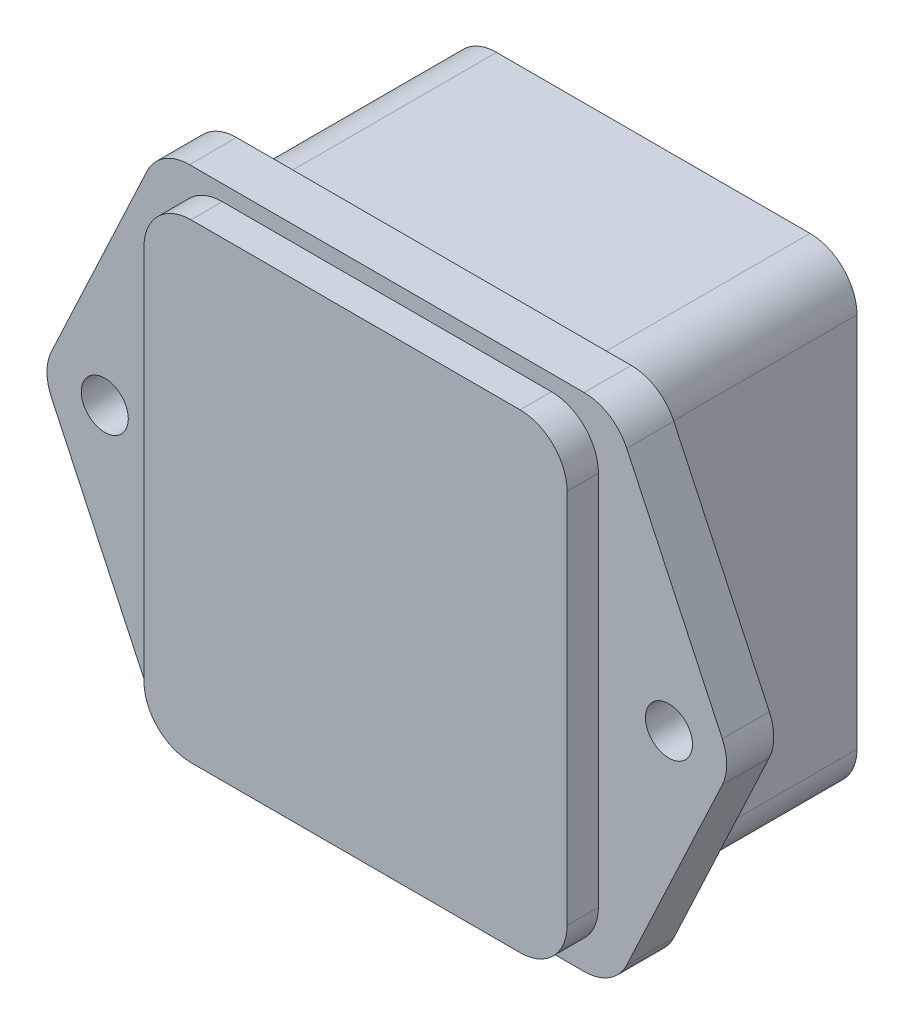
ISO-10303-21;
HEADER;
FILE_DESCRIPTION(('STEP AP214'),'2;1');
FILE_NAME('part.step','',(''),(''),'','','');
FILE_SCHEMA(('AUTOMOTIVE_DESIGN { 1 0 10303 214 1 1 1 1 }'));
ENDSEC;
DATA;
#1=APPLICATION_CONTEXT('core data for automotive mechanical design processes');
#2=APPLICATION_PROTOCOL_DEFINITION('international standard','automotive_design',2000,#1);
#3=PRODUCT_CONTEXT('',#1,'mechanical');
#4=PRODUCT('Part','Part','',(#3));
#5=PRODUCT_RELATED_PRODUCT_CATEGORY('part','',(#4));
#6=PRODUCT_DEFINITION_FORMATION('','',#4);
#7=PRODUCT_DEFINITION_CONTEXT('part definition',#1,'design');
#8=PRODUCT_DEFINITION('design','',#6,#7);
#9=PRODUCT_DEFINITION_SHAPE('','',#8);
#10=(LENGTH_UNIT() NAMED_UNIT(*) SI_UNIT(.MILLI.,.METRE.));
#11=(NAMED_UNIT(*) PLANE_ANGLE_UNIT() SI_UNIT($,.RADIAN.));
#12=(NAMED_UNIT(*) SI_UNIT($,.STERADIAN.) SOLID_ANGLE_UNIT());
#13=UNCERTAINTY_MEASURE_WITH_UNIT(LENGTH_MEASURE(1.E-05),#10,'distance_accuracy_value','');
#14=(GEOMETRIC_REPRESENTATION_CONTEXT(3) GLOBAL_UNCERTAINTY_ASSIGNED_CONTEXT((#13)) GLOBAL_UNIT_ASSIGNED_CONTEXT((#10,
#11,#12)) REPRESENTATION_CONTEXT('',''));
#15=CARTESIAN_POINT('',(0.,0.,0.));
#16=DIRECTION('',(0.,0.,1.));
#17=DIRECTION('',(1.,0.,0.));
#18=AXIS2_PLACEMENT_3D('',#15,#16,#17);
#19=CARTESIAN_POINT('',(0.,0.,0.));
#20=DIRECTION('',(0.,0.,-1.));
#21=DIRECTION('',(-1.,0.,0.));
#22=AXIS2_PLACEMENT_3D('',#19,#20,#21);
#23=PLANE('',#22);
#24=CARTESIAN_POINT('',(-18.,0.,0.));
#25=DIRECTION('',(0.,0.,1.));
#26=DIRECTION('',(1.,0.,0.));
#27=AXIS2_PLACEMENT_3D('',#24,#25,#26);
#28=CIRCLE('',#27,1.5);
#29=CARTESIAN_POINT('',(-16.5,0.,0.));
#30=VERTEX_POINT('',#29);
#31=EDGE_CURVE('E268',#30,#30,#28,.T.);
#32=ORIENTED_EDGE('',*,*,#31,.T.);
#33=EDGE_LOOP('',(#32));
#34=FACE_BOUND('',#33,.T.);
#35=DIRECTION('',(1.,0.,0.));
#36=VECTOR('',#35,1.);
#37=CARTESIAN_POINT('',(14.5,-16.,0.));
#38=LINE('',#37,#36);
#39=CARTESIAN_POINT('',(-12.5930130536739,-16.,0.));
#40=VERTEX_POINT('',#39);
#41=CARTESIAN_POINT('',(12.5930130536739,-16.,0.));
#42=VERTEX_POINT('',#41);
#43=EDGE_CURVE('E300',#40,#42,#38,.T.);
#44=ORIENTED_EDGE('',*,*,#43,.F.);
#45=CARTESIAN_POINT('',(-12.5930130536739,-13.,0.));
#46=DIRECTION('',(0.,0.,-1.));
#47=DIRECTION('',(-1.,0.,0.));
#48=AXIS2_PLACEMENT_3D('',#45,#46,#47);
#49=CIRCLE('',#48,3.);
#50=CARTESIAN_POINT('',(-15.3093898615506,-14.2733016286922,0.));
#51=VERTEX_POINT('',#50);
#52=EDGE_CURVE('E375',#40,#51,#49,.T.);
#53=ORIENTED_EDGE('',*,*,#52,.T.);
#54=DIRECTION('',(0.42443387623072,-0.905458935958869,0.));
#55=VECTOR('',#54,1.);
#56=CARTESIAN_POINT('',(-14.5,-16.,0.));
#57=LINE('',#56,#55);
#58=CARTESIAN_POINT('',(-21.4031398615506,-1.27330162869215,0.));
#59=VERTEX_POINT('',#58);
#60=EDGE_CURVE('E297',#59,#51,#57,.T.);
#61=ORIENTED_EDGE('',*,*,#60,.F.);
#62=CARTESIAN_POINT('',(-18.6867630536739,0.,0.));
#63=DIRECTION('',(0.,0.,-1.));
#64=DIRECTION('',(-1.,0.,0.));
#65=AXIS2_PLACEMENT_3D('',#62,#63,#64);
#66=CIRCLE('',#65,3.);
#67=CARTESIAN_POINT('',(-21.4031398615505,1.27330162869216,0.));
#68=VERTEX_POINT('',#67);
#69=EDGE_CURVE('E373',#59,#68,#66,.T.);
#70=ORIENTED_EDGE('',*,*,#69,.T.);
#71=DIRECTION('',(-0.42443387623072,-0.905458935958869,0.));
#72=VECTOR('',#71,1.);
#73=CARTESIAN_POINT('',(-22.,0.,0.));
#74=LINE('',#73,#72);
#75=CARTESIAN_POINT('',(-15.3093898615505,14.2733016286922,0.));
#76=VERTEX_POINT('',#75);
#77=EDGE_CURVE('E275',#76,#68,#74,.T.);
#78=ORIENTED_EDGE('',*,*,#77,.F.);
#79=CARTESIAN_POINT('',(-12.5930130536739,13.,0.));
#80=DIRECTION('',(0.,0.,-1.));
#81=DIRECTION('',(-1.,0.,0.));
#82=AXIS2_PLACEMENT_3D('',#79,#80,#81);
#83=CIRCLE('',#82,3.);
#84=CARTESIAN_POINT('',(-12.5930130536739,16.,0.));
#85=VERTEX_POINT('',#84);
#86=EDGE_CURVE('E371',#76,#85,#83,.T.);
#87=ORIENTED_EDGE('',*,*,#86,.T.);
#88=DIRECTION('',(-1.,0.,0.));
#89=VECTOR('',#88,1.);
#90=CARTESIAN_POINT('',(-14.5,16.,0.));
#91=LINE('',#90,#89);
#92=CARTESIAN_POINT('',(12.5930130536739,16.,0.));
#93=VERTEX_POINT('',#92);
#94=EDGE_CURVE('E282',#93,#85,#91,.T.);
#95=ORIENTED_EDGE('',*,*,#94,.F.);
#96=CARTESIAN_POINT('',(12.5930130536739,13.,0.));
#97=DIRECTION('',(0.,0.,-1.));
#98=DIRECTION('',(-1.,0.,0.));
#99=AXIS2_PLACEMENT_3D('',#96,#97,#98);
#100=CIRCLE('',#99,3.);
#101=CARTESIAN_POINT('',(15.3093898615506,14.2733016286922,0.));
#102=VERTEX_POINT('',#101);
#103=EDGE_CURVE('E369',#93,#102,#100,.T.);
#104=ORIENTED_EDGE('',*,*,#103,.T.);
#105=DIRECTION('',(-0.424433876230719,0.905458935958869,0.));
#106=VECTOR('',#105,1.);
#107=CARTESIAN_POINT('',(14.5,16.,0.));
#108=LINE('',#107,#106);
#109=CARTESIAN_POINT('',(21.4031398615505,1.27330162869215,0.));
#110=VERTEX_POINT('',#109);
#111=EDGE_CURVE('E306',#110,#102,#108,.T.);
#112=ORIENTED_EDGE('',*,*,#111,.F.);
#113=CARTESIAN_POINT('',(18.6867630536739,0.,0.));
#114=DIRECTION('',(0.,0.,-1.));
#115=DIRECTION('',(-1.,0.,0.));
#116=AXIS2_PLACEMENT_3D('',#113,#114,#115);
#117=CIRCLE('',#116,3.);
#118=CARTESIAN_POINT('',(21.4031398615505,-1.27330162869216,0.));
#119=VERTEX_POINT('',#118);
#120=EDGE_CURVE('E365',#110,#119,#117,.T.);
#121=ORIENTED_EDGE('',*,*,#120,.T.);
#122=DIRECTION('',(0.424433876230719,0.905458935958869,0.));
#123=VECTOR('',#122,1.);
#124=CARTESIAN_POINT('',(22.,0.,0.));
#125=LINE('',#124,#123);
#126=CARTESIAN_POINT('',(15.3093898615506,-14.2733016286922,0.));
#127=VERTEX_POINT('',#126);
#128=EDGE_CURVE('E303',#127,#119,#125,.T.);
#129=ORIENTED_EDGE('',*,*,#128,.F.);
#130=CARTESIAN_POINT('',(12.5930130536739,-13.,0.));
#131=DIRECTION('',(0.,0.,-1.));
#132=DIRECTION('',(-1.,0.,0.));
#133=AXIS2_PLACEMENT_3D('',#130,#131,#132);
#134=CIRCLE('',#133,3.);
#135=EDGE_CURVE('E367',#127,#42,#134,.T.);
#136=ORIENTED_EDGE('',*,*,#135,.T.);
#137=EDGE_LOOP('',(#44,#53,#61,#70,#78,#87,#95,#104,#112,#121,#129,#136));
#138=FACE_BOUND('',#137,.T.);
#139=CARTESIAN_POINT('',(18.,0.,0.));
#140=DIRECTION('',(0.,0.,1.));
#141=DIRECTION('',(1.,0.,0.));
#142=AXIS2_PLACEMENT_3D('',#139,#140,#141);
#143=CIRCLE('',#142,1.5);
#144=CARTESIAN_POINT('',(19.5,0.,0.));
#145=VERTEX_POINT('',#144);
#146=EDGE_CURVE('E269',#145,#145,#143,.T.);
#147=ORIENTED_EDGE('',*,*,#146,.T.);
#148=EDGE_LOOP('',(#147));
#149=FACE_BOUND('',#148,.T.);
#150=DIRECTION('',(1.,0.,0.));
#151=VECTOR('',#150,1.);
#152=CARTESIAN_POINT('',(13.,15.,0.));
#153=LINE('',#152,#151);
#154=CARTESIAN_POINT('',(-9.99999999999999,15.,0.));
#155=VERTEX_POINT('',#154);
#156=CARTESIAN_POINT('',(10.,15.,0.));
#157=VERTEX_POINT('',#156);
#158=EDGE_CURVE('E424',#155,#157,#153,.T.);
#159=ORIENTED_EDGE('',*,*,#158,.F.);
#160=CARTESIAN_POINT('',(-10.,12.,0.));
#161=DIRECTION('',(0.,0.,-1.));
#162=DIRECTION('',(-1.,0.,0.));
#163=AXIS2_PLACEMENT_3D('',#160,#161,#162);
#164=CIRCLE('',#163,3.);
#165=CARTESIAN_POINT('',(-13.,12.,0.));
#166=VERTEX_POINT('',#165);
#167=EDGE_CURVE('E43',#155,#166,#164,.F.);
#168=ORIENTED_EDGE('',*,*,#167,.T.);
#169=DIRECTION('',(0.,1.,0.));
#170=VECTOR('',#169,1.);
#171=CARTESIAN_POINT('',(-13.,-15.,0.));
#172=LINE('',#171,#170);
#173=CARTESIAN_POINT('',(-13.,-12.,0.));
#174=VERTEX_POINT('',#173);
#175=EDGE_CURVE('E422',#174,#166,#172,.T.);
#176=ORIENTED_EDGE('',*,*,#175,.F.);
#177=CARTESIAN_POINT('',(-10.,-12.,0.));
#178=DIRECTION('',(0.,0.,-1.));
#179=DIRECTION('',(-1.,0.,0.));
#180=AXIS2_PLACEMENT_3D('',#177,#178,#179);
#181=CIRCLE('',#180,3.);
#182=CARTESIAN_POINT('',(-9.99999999999999,-15.,0.));
#183=VERTEX_POINT('',#182);
#184=EDGE_CURVE('E11',#174,#183,#181,.F.);
#185=ORIENTED_EDGE('',*,*,#184,.T.);
#186=DIRECTION('',(-1.,0.,0.));
#187=VECTOR('',#186,1.);
#188=CARTESIAN_POINT('',(13.,-15.,0.));
#189=LINE('',#188,#187);
#190=CARTESIAN_POINT('',(10.,-15.,0.));
#191=VERTEX_POINT('',#190);
#192=EDGE_CURVE('E449',#191,#183,#189,.T.);
#193=ORIENTED_EDGE('',*,*,#192,.F.);
#194=CARTESIAN_POINT('',(10.,-12.,0.));
#195=DIRECTION('',(0.,0.,-1.));
#196=DIRECTION('',(-1.,0.,0.));
#197=AXIS2_PLACEMENT_3D('',#194,#195,#196);
#198=CIRCLE('',#197,3.);
#199=CARTESIAN_POINT('',(13.,-12.,0.));
#200=VERTEX_POINT('',#199);
#201=EDGE_CURVE('E415',#191,#200,#198,.F.);
#202=ORIENTED_EDGE('',*,*,#201,.T.);
#203=DIRECTION('',(0.,-1.,0.));
#204=VECTOR('',#203,1.);
#205=CARTESIAN_POINT('',(13.,-15.,0.));
#206=LINE('',#205,#204);
#207=CARTESIAN_POINT('',(13.,12.,0.));
#208=VERTEX_POINT('',#207);
#209=EDGE_CURVE('E453',#208,#200,#206,.T.);
#210=ORIENTED_EDGE('',*,*,#209,.F.);
#211=CARTESIAN_POINT('',(10.,12.,0.));
#212=DIRECTION('',(0.,0.,-1.));
#213=DIRECTION('',(-1.,0.,0.));
#214=AXIS2_PLACEMENT_3D('',#211,#212,#213);
#215=CIRCLE('',#214,3.);
#216=EDGE_CURVE('E417',#208,#157,#215,.F.);
#217=ORIENTED_EDGE('',*,*,#216,.T.);
#218=EDGE_LOOP('',(#159,#168,#176,#185,#193,#202,#210,#217));
#219=FACE_BOUND('',#218,.T.);
#220=ADVANCED_FACE('F35',(#34,#138,#149,#219),#23,.T.);
#221=CARTESIAN_POINT('',(0.,0.,3.));
#222=DIRECTION('',(0.,0.,-1.));
#223=DIRECTION('',(-1.,0.,0.));
#224=AXIS2_PLACEMENT_3D('',#221,#222,#223);
#225=PLANE('',#224);
#226=CARTESIAN_POINT('',(18.,0.,3.));
#227=DIRECTION('',(0.,0.,1.));
#228=DIRECTION('',(1.,0.,0.));
#229=AXIS2_PLACEMENT_3D('',#226,#227,#228);
#230=CIRCLE('',#229,1.5);
#231=CARTESIAN_POINT('',(19.5,0.,3.));
#232=VERTEX_POINT('',#231);
#233=EDGE_CURVE('E265',#232,#232,#230,.T.);
#234=ORIENTED_EDGE('',*,*,#233,.F.);
#235=EDGE_LOOP('',(#234));
#236=FACE_BOUND('',#235,.T.);
#237=CARTESIAN_POINT('',(-18.,0.,3.));
#238=DIRECTION('',(0.,0.,1.));
#239=DIRECTION('',(1.,0.,0.));
#240=AXIS2_PLACEMENT_3D('',#237,#238,#239);
#241=CIRCLE('',#240,1.5);
#242=CARTESIAN_POINT('',(-16.5,0.,3.));
#243=VERTEX_POINT('',#242);
#244=EDGE_CURVE('E272',#243,#243,#241,.T.);
#245=ORIENTED_EDGE('',*,*,#244,.F.);
#246=EDGE_LOOP('',(#245));
#247=FACE_BOUND('',#246,.T.);
#248=DIRECTION('',(0.42443387623072,-0.905458935958869,0.));
#249=VECTOR('',#248,1.);
#250=CARTESIAN_POINT('',(-14.5,-16.,3.));
#251=LINE('',#250,#249);
#252=CARTESIAN_POINT('',(-21.4031398615506,-1.27330162869215,3.));
#253=VERTEX_POINT('',#252);
#254=CARTESIAN_POINT('',(-15.3093898615506,-14.2733016286922,3.));
#255=VERTEX_POINT('',#254);
#256=EDGE_CURVE('E281',#253,#255,#251,.T.);
#257=ORIENTED_EDGE('',*,*,#256,.T.);
#258=CARTESIAN_POINT('',(-12.5930130536739,-13.,3.));
#259=DIRECTION('',(0.,0.,-1.));
#260=DIRECTION('',(-1.,0.,0.));
#261=AXIS2_PLACEMENT_3D('',#258,#259,#260);
#262=CIRCLE('',#261,3.);
#263=CARTESIAN_POINT('',(-12.5930130536739,-16.,3.));
#264=VERTEX_POINT('',#263);
#265=EDGE_CURVE('E391',#255,#264,#262,.F.);
#266=ORIENTED_EDGE('',*,*,#265,.T.);
#267=DIRECTION('',(1.,0.,0.));
#268=VECTOR('',#267,1.);
#269=CARTESIAN_POINT('',(14.5,-16.,3.));
#270=LINE('',#269,#268);
#271=CARTESIAN_POINT('',(12.5930130536739,-16.,3.));
#272=VERTEX_POINT('',#271);
#273=EDGE_CURVE('E285',#264,#272,#270,.T.);
#274=ORIENTED_EDGE('',*,*,#273,.T.);
#275=CARTESIAN_POINT('',(12.5930130536739,-13.,3.));
#276=DIRECTION('',(0.,0.,-1.));
#277=DIRECTION('',(-1.,0.,0.));
#278=AXIS2_PLACEMENT_3D('',#275,#276,#277);
#279=CIRCLE('',#278,3.);
#280=CARTESIAN_POINT('',(15.3093898615506,-14.2733016286922,3.));
#281=VERTEX_POINT('',#280);
#282=EDGE_CURVE('E384',#272,#281,#279,.F.);
#283=ORIENTED_EDGE('',*,*,#282,.T.);
#284=DIRECTION('',(0.424433876230719,0.905458935958869,0.));
#285=VECTOR('',#284,1.);
#286=CARTESIAN_POINT('',(22.,0.,3.));
#287=LINE('',#286,#285);
#288=CARTESIAN_POINT('',(21.4031398615505,-1.27330162869216,3.));
#289=VERTEX_POINT('',#288);
#290=EDGE_CURVE('E288',#281,#289,#287,.T.);
#291=ORIENTED_EDGE('',*,*,#290,.T.);
#292=CARTESIAN_POINT('',(18.6867630536739,0.,3.));
#293=DIRECTION('',(0.,0.,-1.));
#294=DIRECTION('',(-1.,0.,0.));
#295=AXIS2_PLACEMENT_3D('',#292,#293,#294);
#296=CIRCLE('',#295,3.);
#297=CARTESIAN_POINT('',(21.4031398615505,1.27330162869215,3.));
#298=VERTEX_POINT('',#297);
#299=EDGE_CURVE('E382',#289,#298,#296,.F.);
#300=ORIENTED_EDGE('',*,*,#299,.T.);
#301=DIRECTION('',(-0.424433876230719,0.905458935958869,0.));
#302=VECTOR('',#301,1.);
#303=CARTESIAN_POINT('',(14.5,16.,3.));
#304=LINE('',#303,#302);
#305=CARTESIAN_POINT('',(15.3093898615506,14.2733016286922,3.));
#306=VERTEX_POINT('',#305);
#307=EDGE_CURVE('E291',#298,#306,#304,.T.);
#308=ORIENTED_EDGE('',*,*,#307,.T.);
#309=CARTESIAN_POINT('',(12.5930130536739,13.,3.));
#310=DIRECTION('',(0.,0.,-1.));
#311=DIRECTION('',(-1.,0.,0.));
#312=AXIS2_PLACEMENT_3D('',#309,#310,#311);
#313=CIRCLE('',#312,3.);
#314=CARTESIAN_POINT('',(12.5930130536739,16.,3.));
#315=VERTEX_POINT('',#314);
#316=EDGE_CURVE('E57',#306,#315,#313,.F.);
#317=ORIENTED_EDGE('',*,*,#316,.T.);
#318=DIRECTION('',(-1.,0.,0.));
#319=VECTOR('',#318,1.);
#320=CARTESIAN_POINT('',(-14.5,16.,3.));
#321=LINE('',#320,#319);
#322=CARTESIAN_POINT('',(-12.5930130536739,16.,3.));
#323=VERTEX_POINT('',#322);
#324=EDGE_CURVE('E293',#315,#323,#321,.T.);
#325=ORIENTED_EDGE('',*,*,#324,.T.);
#326=CARTESIAN_POINT('',(-12.5930130536739,13.,3.));
#327=DIRECTION('',(0.,0.,-1.));
#328=DIRECTION('',(-1.,0.,0.));
#329=AXIS2_PLACEMENT_3D('',#326,#327,#328);
#330=CIRCLE('',#329,3.);
#331=CARTESIAN_POINT('',(-15.3093898615505,14.2733016286922,3.));
#332=VERTEX_POINT('',#331);
#333=EDGE_CURVE('E387',#323,#332,#330,.F.);
#334=ORIENTED_EDGE('',*,*,#333,.T.);
#335=DIRECTION('',(-0.42443387623072,-0.905458935958869,0.));
#336=VECTOR('',#335,1.);
#337=CARTESIAN_POINT('',(-22.,0.,3.));
#338=LINE('',#337,#336);
#339=CARTESIAN_POINT('',(-21.4031398615505,1.27330162869216,3.));
#340=VERTEX_POINT('',#339);
#341=EDGE_CURVE('E278',#332,#340,#338,.T.);
#342=ORIENTED_EDGE('',*,*,#341,.T.);
#343=CARTESIAN_POINT('',(-18.6867630536739,0.,3.));
#344=DIRECTION('',(0.,0.,-1.));
#345=DIRECTION('',(-1.,0.,0.));
#346=AXIS2_PLACEMENT_3D('',#343,#344,#345);
#347=CIRCLE('',#346,3.);
#348=EDGE_CURVE('E389',#340,#253,#347,.F.);
#349=ORIENTED_EDGE('',*,*,#348,.T.);
#350=EDGE_LOOP('',(#257,#266,#274,#283,#291,#300,#308,#317,#325,#334,#342,#349));
#351=FACE_BOUND('',#350,.T.);
#352=DIRECTION('',(0.,1.,0.));
#353=VECTOR('',#352,1.);
#354=CARTESIAN_POINT('',(13.5,15.,3.));
#355=LINE('',#354,#353);
#356=CARTESIAN_POINT('',(13.5,-12.,3.));
#357=VERTEX_POINT('',#356);
#358=CARTESIAN_POINT('',(13.5,12.,3.));
#359=VERTEX_POINT('',#358);
#360=EDGE_CURVE('E238',#357,#359,#355,.T.);
#361=ORIENTED_EDGE('',*,*,#360,.F.);
#362=CARTESIAN_POINT('',(10.5,-12.,3.));
#363=DIRECTION('',(0.,0.,-1.));
#364=DIRECTION('',(-1.,0.,0.));
#365=AXIS2_PLACEMENT_3D('',#362,#363,#364);
#366=CIRCLE('',#365,3.);
#367=CARTESIAN_POINT('',(10.5,-15.,3.));
#368=VERTEX_POINT('',#367);
#369=EDGE_CURVE('E221',#357,#368,#366,.T.);
#370=ORIENTED_EDGE('',*,*,#369,.T.);
#371=DIRECTION('',(1.,0.,0.));
#372=VECTOR('',#371,1.);
#373=CARTESIAN_POINT('',(-13.5,-15.,3.));
#374=LINE('',#373,#372);
#375=CARTESIAN_POINT('',(-10.5,-15.,3.));
#376=VERTEX_POINT('',#375);
#377=EDGE_CURVE('E263',#376,#368,#374,.T.);
#378=ORIENTED_EDGE('',*,*,#377,.F.);
#379=CARTESIAN_POINT('',(-10.5,-12.,3.));
#380=DIRECTION('',(0.,0.,-1.));
#381=DIRECTION('',(-1.,0.,0.));
#382=AXIS2_PLACEMENT_3D('',#379,#380,#381);
#383=CIRCLE('',#382,3.);
#384=CARTESIAN_POINT('',(-13.5,-12.,3.));
#385=VERTEX_POINT('',#384);
#386=EDGE_CURVE('E231',#376,#385,#383,.T.);
#387=ORIENTED_EDGE('',*,*,#386,.T.);
#388=DIRECTION('',(0.,-1.,0.));
#389=VECTOR('',#388,1.);
#390=CARTESIAN_POINT('',(-13.5,15.,3.));
#391=LINE('',#390,#389);
#392=CARTESIAN_POINT('',(-13.5,12.,3.));
#393=VERTEX_POINT('',#392);
#394=EDGE_CURVE('E252',#393,#385,#391,.T.);
#395=ORIENTED_EDGE('',*,*,#394,.F.);
#396=CARTESIAN_POINT('',(-10.5,12.,3.));
#397=DIRECTION('',(0.,0.,-1.));
#398=DIRECTION('',(-1.,0.,0.));
#399=AXIS2_PLACEMENT_3D('',#396,#397,#398);
#400=CIRCLE('',#399,3.);
#401=CARTESIAN_POINT('',(-10.5,15.,3.));
#402=VERTEX_POINT('',#401);
#403=EDGE_CURVE('E412',#393,#402,#400,.T.);
#404=ORIENTED_EDGE('',*,*,#403,.T.);
#405=DIRECTION('',(-1.,0.,0.));
#406=VECTOR('',#405,1.);
#407=CARTESIAN_POINT('',(-13.5,15.,3.));
#408=LINE('',#407,#406);
#409=CARTESIAN_POINT('',(10.5,15.,3.));
#410=VERTEX_POINT('',#409);
#411=EDGE_CURVE('E248',#410,#402,#408,.T.);
#412=ORIENTED_EDGE('',*,*,#411,.F.);
#413=CARTESIAN_POINT('',(10.5,12.,3.));
#414=DIRECTION('',(0.,0.,-1.));
#415=DIRECTION('',(-1.,0.,0.));
#416=AXIS2_PLACEMENT_3D('',#413,#414,#415);
#417=CIRCLE('',#416,3.);
#418=EDGE_CURVE('E247',#410,#359,#417,.T.);
#419=ORIENTED_EDGE('',*,*,#418,.T.);
#420=EDGE_LOOP('',(#361,#370,#378,#387,#395,#404,#412,#419));
#421=FACE_BOUND('',#420,.T.);
#422=ADVANCED_FACE('F245',(#236,#247,#351,#421),#225,.F.);
#423=CARTESIAN_POINT('',(-22.,0.,3.));
#424=DIRECTION('',(0.905458935958868,-0.424433876230719,0.));
#425=DIRECTION('',(0.42443387623072,0.905458935958869,0.));
#426=AXIS2_PLACEMENT_3D('',#423,#424,#425);
#427=PLANE('',#426);
#428=ORIENTED_EDGE('',*,*,#77,.T.);
#429=DIRECTION('',(0.,0.,-1.));
#430=VECTOR('',#429,1.);
#431=CARTESIAN_POINT('',(-21.4031398615505,1.27330162869216,3.));
#432=LINE('',#431,#430);
#433=EDGE_CURVE('E396',#68,#340,#432,.F.);
#434=ORIENTED_EDGE('',*,*,#433,.T.);
#435=ORIENTED_EDGE('',*,*,#341,.F.);
#436=DIRECTION('',(0.,0.,-1.));
#437=VECTOR('',#436,1.);
#438=CARTESIAN_POINT('',(-15.3093898615506,14.2733016286922,3.));
#439=LINE('',#438,#437);
#440=EDGE_CURVE('E393',#332,#76,#439,.T.);
#441=ORIENTED_EDGE('',*,*,#440,.T.);
#442=EDGE_LOOP('',(#428,#434,#435,#441));
#443=FACE_BOUND('',#442,.T.);
#444=ADVANCED_FACE('F507',(#443),#427,.F.);
#445=CARTESIAN_POINT('',(-14.5,-16.,3.));
#446=DIRECTION('',(0.905458935958868,0.424433876230719,0.));
#447=DIRECTION('',(-0.42443387623072,0.905458935958869,0.));
#448=AXIS2_PLACEMENT_3D('',#445,#446,#447);
#449=PLANE('',#448);
#450=ORIENTED_EDGE('',*,*,#60,.T.);
#451=DIRECTION('',(0.,0.,-1.));
#452=VECTOR('',#451,1.);
#453=CARTESIAN_POINT('',(-15.3093898615506,-14.2733016286922,3.));
#454=LINE('',#453,#452);
#455=EDGE_CURVE('E380',#51,#255,#454,.F.);
#456=ORIENTED_EDGE('',*,*,#455,.T.);
#457=ORIENTED_EDGE('',*,*,#256,.F.);
#458=DIRECTION('',(0.,0.,-1.));
#459=VECTOR('',#458,1.);
#460=CARTESIAN_POINT('',(-21.4031398615505,-1.27330162869216,3.));
#461=LINE('',#460,#459);
#462=EDGE_CURVE('E377',#253,#59,#461,.T.);
#463=ORIENTED_EDGE('',*,*,#462,.T.);
#464=EDGE_LOOP('',(#450,#456,#457,#463));
#465=FACE_BOUND('',#464,.T.);
#466=ADVANCED_FACE('F528',(#465),#449,.F.);
#467=CARTESIAN_POINT('',(14.5,-16.,3.));
#468=DIRECTION('',(0.,1.,0.));
#469=DIRECTION('',(0.,0.,1.));
#470=AXIS2_PLACEMENT_3D('',#467,#468,#469);
#471=PLANE('',#470);
#472=ORIENTED_EDGE('',*,*,#273,.F.);
#473=DIRECTION('',(0.,0.,-1.));
#474=VECTOR('',#473,1.);
#475=CARTESIAN_POINT('',(-12.5930130536739,-16.,3.));
#476=LINE('',#475,#474);
#477=EDGE_CURVE('E362',#264,#40,#476,.T.);
#478=ORIENTED_EDGE('',*,*,#477,.T.);
#479=ORIENTED_EDGE('',*,*,#43,.T.);
#480=DIRECTION('',(0.,0.,-1.));
#481=VECTOR('',#480,1.);
#482=CARTESIAN_POINT('',(12.5930130536739,-16.,3.));
#483=LINE('',#482,#481);
#484=EDGE_CURVE('E360',#42,#272,#483,.F.);
#485=ORIENTED_EDGE('',*,*,#484,.T.);
#486=EDGE_LOOP('',(#472,#478,#479,#485));
#487=FACE_BOUND('',#486,.T.);
#488=ADVANCED_FACE('F524',(#487),#471,.F.);
#489=CARTESIAN_POINT('',(22.,0.,3.));
#490=DIRECTION('',(-0.905458935958868,0.424433876230719,0.));
#491=DIRECTION('',(-0.424433876230719,-0.905458935958869,0.));
#492=AXIS2_PLACEMENT_3D('',#489,#490,#491);
#493=PLANE('',#492);
#494=ORIENTED_EDGE('',*,*,#290,.F.);
#495=DIRECTION('',(0.,0.,-1.));
#496=VECTOR('',#495,1.);
#497=CARTESIAN_POINT('',(15.3093898615506,-14.2733016286922,3.));
#498=LINE('',#497,#496);
#499=EDGE_CURVE('E232',#281,#127,#498,.T.);
#500=ORIENTED_EDGE('',*,*,#499,.T.);
#501=ORIENTED_EDGE('',*,*,#128,.T.);
#502=DIRECTION('',(0.,0.,-1.));
#503=VECTOR('',#502,1.);
#504=CARTESIAN_POINT('',(21.4031398615505,-1.27330162869216,3.));
#505=LINE('',#504,#503);
#506=EDGE_CURVE('E407',#119,#289,#505,.F.);
#507=ORIENTED_EDGE('',*,*,#506,.T.);
#508=EDGE_LOOP('',(#494,#500,#501,#507));
#509=FACE_BOUND('',#508,.T.);
#510=ADVANCED_FACE('F520',(#509),#493,.F.);
#511=CARTESIAN_POINT('',(14.5,16.,3.));
#512=DIRECTION('',(-0.905458935958868,-0.424433876230719,0.));
#513=DIRECTION('',(0.424433876230719,-0.905458935958869,0.));
#514=AXIS2_PLACEMENT_3D('',#511,#512,#513);
#515=PLANE('',#514);
#516=ORIENTED_EDGE('',*,*,#111,.T.);
#517=DIRECTION('',(0.,0.,-1.));
#518=VECTOR('',#517,1.);
#519=CARTESIAN_POINT('',(15.3093898615506,14.2733016286922,3.));
#520=LINE('',#519,#518);
#521=EDGE_CURVE('E405',#102,#306,#520,.F.);
#522=ORIENTED_EDGE('',*,*,#521,.T.);
#523=ORIENTED_EDGE('',*,*,#307,.F.);
#524=DIRECTION('',(0.,0.,-1.));
#525=VECTOR('',#524,1.);
#526=CARTESIAN_POINT('',(21.4031398615505,1.27330162869216,3.));
#527=LINE('',#526,#525);
#528=EDGE_CURVE('E402',#298,#110,#527,.T.);
#529=ORIENTED_EDGE('',*,*,#528,.T.);
#530=EDGE_LOOP('',(#516,#522,#523,#529));
#531=FACE_BOUND('',#530,.T.);
#532=ADVANCED_FACE('F517',(#531),#515,.F.);
#533=CARTESIAN_POINT('',(-14.5,16.,3.));
#534=DIRECTION('',(0.,-1.,0.));
#535=DIRECTION('',(0.,0.,-1.));
#536=AXIS2_PLACEMENT_3D('',#533,#534,#535);
#537=PLANE('',#536);
#538=ORIENTED_EDGE('',*,*,#94,.T.);
#539=DIRECTION('',(0.,0.,-1.));
#540=VECTOR('',#539,1.);
#541=CARTESIAN_POINT('',(-12.5930130536739,16.,3.));
#542=LINE('',#541,#540);
#543=EDGE_CURVE('E50',#85,#323,#542,.F.);
#544=ORIENTED_EDGE('',*,*,#543,.T.);
#545=ORIENTED_EDGE('',*,*,#324,.F.);
#546=DIRECTION('',(0.,0.,-1.));
#547=VECTOR('',#546,1.);
#548=CARTESIAN_POINT('',(12.5930130536739,16.,3.));
#549=LINE('',#548,#547);
#550=EDGE_CURVE('E398',#315,#93,#549,.T.);
#551=ORIENTED_EDGE('',*,*,#550,.T.);
#552=EDGE_LOOP('',(#538,#544,#545,#551));
#553=FACE_BOUND('',#552,.T.);
#554=ADVANCED_FACE('F513',(#553),#537,.F.);
#555=CARTESIAN_POINT('',(-18.,0.,3.));
#556=DIRECTION('',(0.,0.,-1.));
#557=DIRECTION('',(-1.,0.,0.));
#558=AXIS2_PLACEMENT_3D('',#555,#556,#557);
#559=CYLINDRICAL_SURFACE('',#558,1.5);
#560=ORIENTED_EDGE('',*,*,#244,.T.);
#561=EDGE_LOOP('',(#560));
#562=FACE_BOUND('',#561,.T.);
#563=ORIENTED_EDGE('',*,*,#31,.F.);
#564=EDGE_LOOP('',(#563));
#565=FACE_BOUND('',#564,.T.);
#566=ADVANCED_FACE('F516',(#562,#565),#559,.F.);
#567=CARTESIAN_POINT('',(18.,0.,3.));
#568=DIRECTION('',(0.,0.,-1.));
#569=DIRECTION('',(-1.,0.,0.));
#570=AXIS2_PLACEMENT_3D('',#567,#568,#569);
#571=CYLINDRICAL_SURFACE('',#570,1.5);
#572=ORIENTED_EDGE('',*,*,#233,.T.);
#573=EDGE_LOOP('',(#572));
#574=FACE_BOUND('',#573,.T.);
#575=ORIENTED_EDGE('',*,*,#146,.F.);
#576=EDGE_LOOP('',(#575));
#577=FACE_BOUND('',#576,.T.);
#578=ADVANCED_FACE('F676',(#574,#577),#571,.F.);
#579=CARTESIAN_POINT('',(13.5,15.,5.));
#580=DIRECTION('',(-1.,0.,0.));
#581=DIRECTION('',(0.,-1.,0.));
#582=AXIS2_PLACEMENT_3D('',#579,#580,#581);
#583=PLANE('',#582);
#584=DIRECTION('',(0.,1.,0.));
#585=VECTOR('',#584,1.);
#586=CARTESIAN_POINT('',(13.5,15.,5.));
#587=LINE('',#586,#585);
#588=CARTESIAN_POINT('',(13.5,-12.,5.));
#589=VERTEX_POINT('',#588);
#590=CARTESIAN_POINT('',(13.5,12.,5.));
#591=VERTEX_POINT('',#590);
#592=EDGE_CURVE('E241',#589,#591,#587,.T.);
#593=ORIENTED_EDGE('',*,*,#592,.F.);
#594=DIRECTION('',(0.,0.,-1.));
#595=VECTOR('',#594,1.);
#596=CARTESIAN_POINT('',(13.5,-12.,5.));
#597=LINE('',#596,#595);
#598=EDGE_CURVE('E225',#589,#357,#597,.T.);
#599=ORIENTED_EDGE('',*,*,#598,.T.);
#600=ORIENTED_EDGE('',*,*,#360,.T.);
#601=DIRECTION('',(0.,0.,-1.));
#602=VECTOR('',#601,1.);
#603=CARTESIAN_POINT('',(13.5,12.,5.));
#604=LINE('',#603,#602);
#605=EDGE_CURVE('E243',#359,#591,#604,.F.);
#606=ORIENTED_EDGE('',*,*,#605,.T.);
#607=EDGE_LOOP('',(#593,#599,#600,#606));
#608=FACE_BOUND('',#607,.T.);
#609=ADVANCED_FACE('F237',(#608),#583,.F.);
#610=CARTESIAN_POINT('',(-13.5,15.,5.));
#611=DIRECTION('',(0.,-1.,0.));
#612=DIRECTION('',(0.,0.,-1.));
#613=AXIS2_PLACEMENT_3D('',#610,#611,#612);
#614=PLANE('',#613);
#615=ORIENTED_EDGE('',*,*,#411,.T.);
#616=DIRECTION('',(0.,0.,-1.));
#617=VECTOR('',#616,1.);
#618=CARTESIAN_POINT('',(-10.5,15.,5.));
#619=LINE('',#618,#617);
#620=CARTESIAN_POINT('',(-10.5,15.,5.));
#621=VERTEX_POINT('',#620);
#622=EDGE_CURVE('E330',#402,#621,#619,.F.);
#623=ORIENTED_EDGE('',*,*,#622,.T.);
#624=DIRECTION('',(-1.,0.,0.));
#625=VECTOR('',#624,1.);
#626=CARTESIAN_POINT('',(-13.5,15.,5.));
#627=LINE('',#626,#625);
#628=CARTESIAN_POINT('',(10.5,15.,5.));
#629=VERTEX_POINT('',#628);
#630=EDGE_CURVE('E459',#629,#621,#627,.T.);
#631=ORIENTED_EDGE('',*,*,#630,.F.);
#632=DIRECTION('',(0.,0.,-1.));
#633=VECTOR('',#632,1.);
#634=CARTESIAN_POINT('',(10.5,15.,5.));
#635=LINE('',#634,#633);
#636=EDGE_CURVE('E327',#629,#410,#635,.T.);
#637=ORIENTED_EDGE('',*,*,#636,.T.);
#638=EDGE_LOOP('',(#615,#623,#631,#637));
#639=FACE_BOUND('',#638,.T.);
#640=ADVANCED_FACE('F484',(#639),#614,.F.);
#641=CARTESIAN_POINT('',(-13.5,15.,5.));
#642=DIRECTION('',(1.,0.,0.));
#643=DIRECTION('',(0.,1.,0.));
#644=AXIS2_PLACEMENT_3D('',#641,#642,#643);
#645=PLANE('',#644);
#646=ORIENTED_EDGE('',*,*,#394,.T.);
#647=DIRECTION('',(0.,0.,-1.));
#648=VECTOR('',#647,1.);
#649=CARTESIAN_POINT('',(-13.5,-12.,5.));
#650=LINE('',#649,#648);
#651=CARTESIAN_POINT('',(-13.5,-12.,5.));
#652=VERTEX_POINT('',#651);
#653=EDGE_CURVE('E325',#385,#652,#650,.F.);
#654=ORIENTED_EDGE('',*,*,#653,.T.);
#655=DIRECTION('',(0.,-1.,0.));
#656=VECTOR('',#655,1.);
#657=CARTESIAN_POINT('',(-13.5,15.,5.));
#658=LINE('',#657,#656);
#659=CARTESIAN_POINT('',(-13.5,12.,5.));
#660=VERTEX_POINT('',#659);
#661=EDGE_CURVE('E461',#660,#652,#658,.T.);
#662=ORIENTED_EDGE('',*,*,#661,.F.);
#663=DIRECTION('',(0.,0.,-1.));
#664=VECTOR('',#663,1.);
#665=CARTESIAN_POINT('',(-13.5,12.,5.));
#666=LINE('',#665,#664);
#667=EDGE_CURVE('E322',#660,#393,#666,.T.);
#668=ORIENTED_EDGE('',*,*,#667,.T.);
#669=EDGE_LOOP('',(#646,#654,#662,#668));
#670=FACE_BOUND('',#669,.T.);
#671=ADVANCED_FACE('F477',(#670),#645,.F.);
#672=CARTESIAN_POINT('',(-13.5,-15.,5.));
#673=DIRECTION('',(0.,1.,0.));
#674=DIRECTION('',(0.,0.,1.));
#675=AXIS2_PLACEMENT_3D('',#672,#673,#674);
#676=PLANE('',#675);
#677=ORIENTED_EDGE('',*,*,#377,.T.);
#678=DIRECTION('',(0.,0.,-1.));
#679=VECTOR('',#678,1.);
#680=CARTESIAN_POINT('',(10.5,-15.,5.));
#681=LINE('',#680,#679);
#682=CARTESIAN_POINT('',(10.5,-15.,5.));
#683=VERTEX_POINT('',#682);
#684=EDGE_CURVE('E226',#368,#683,#681,.F.);
#685=ORIENTED_EDGE('',*,*,#684,.T.);
#686=DIRECTION('',(1.,0.,0.));
#687=VECTOR('',#686,1.);
#688=CARTESIAN_POINT('',(-13.5,-15.,5.));
#689=LINE('',#688,#687);
#690=CARTESIAN_POINT('',(-10.5,-15.,5.));
#691=VERTEX_POINT('',#690);
#692=EDGE_CURVE('E258',#691,#683,#689,.T.);
#693=ORIENTED_EDGE('',*,*,#692,.F.);
#694=DIRECTION('',(0.,0.,-1.));
#695=VECTOR('',#694,1.);
#696=CARTESIAN_POINT('',(-10.5,-15.,5.));
#697=LINE('',#696,#695);
#698=EDGE_CURVE('E242',#691,#376,#697,.T.);
#699=ORIENTED_EDGE('',*,*,#698,.T.);
#700=EDGE_LOOP('',(#677,#685,#693,#699));
#701=FACE_BOUND('',#700,.T.);
#702=ADVANCED_FACE('F471',(#701),#676,.F.);
#703=CARTESIAN_POINT('',(0.,0.,5.));
#704=DIRECTION('',(0.,0.,1.));
#705=DIRECTION('',(1.,0.,0.));
#706=AXIS2_PLACEMENT_3D('',#703,#704,#705);
#707=PLANE('',#706);
#708=ORIENTED_EDGE('',*,*,#692,.T.);
#709=CARTESIAN_POINT('',(10.5,-12.,5.));
#710=DIRECTION('',(0.,0.,1.));
#711=DIRECTION('',(1.,0.,0.));
#712=AXIS2_PLACEMENT_3D('',#709,#710,#711);
#713=CIRCLE('',#712,3.);
#714=EDGE_CURVE('E320',#683,#589,#713,.T.);
#715=ORIENTED_EDGE('',*,*,#714,.T.);
#716=ORIENTED_EDGE('',*,*,#592,.T.);
#717=CARTESIAN_POINT('',(10.5,12.,5.));
#718=DIRECTION('',(0.,0.,1.));
#719=DIRECTION('',(1.,0.,0.));
#720=AXIS2_PLACEMENT_3D('',#717,#718,#719);
#721=CIRCLE('',#720,3.);
#722=EDGE_CURVE('E314',#591,#629,#721,.T.);
#723=ORIENTED_EDGE('',*,*,#722,.T.);
#724=ORIENTED_EDGE('',*,*,#630,.T.);
#725=CARTESIAN_POINT('',(-10.5,12.,5.));
#726=DIRECTION('',(0.,0.,1.));
#727=DIRECTION('',(1.,0.,0.));
#728=AXIS2_PLACEMENT_3D('',#725,#726,#727);
#729=CIRCLE('',#728,3.);
#730=EDGE_CURVE('E316',#621,#660,#729,.T.);
#731=ORIENTED_EDGE('',*,*,#730,.T.);
#732=ORIENTED_EDGE('',*,*,#661,.T.);
#733=CARTESIAN_POINT('',(-10.5,-12.,5.));
#734=DIRECTION('',(0.,0.,1.));
#735=DIRECTION('',(1.,0.,0.));
#736=AXIS2_PLACEMENT_3D('',#733,#734,#735);
#737=CIRCLE('',#736,3.);
#738=EDGE_CURVE('E318',#652,#691,#737,.T.);
#739=ORIENTED_EDGE('',*,*,#738,.T.);
#740=EDGE_LOOP('',(#708,#715,#716,#723,#724,#731,#732,#739));
#741=FACE_BOUND('',#740,.T.);
#742=ADVANCED_FACE('F468',(#741),#707,.T.);
#743=CARTESIAN_POINT('',(-13.,-15.,-14.));
#744=DIRECTION('',(1.,0.,0.));
#745=DIRECTION('',(0.,0.,-1.));
#746=AXIS2_PLACEMENT_3D('',#743,#744,#745);
#747=PLANE('',#746);
#748=ORIENTED_EDGE('',*,*,#175,.T.);
#749=DIRECTION('',(0.,0.,1.));
#750=VECTOR('',#749,1.);
#751=CARTESIAN_POINT('',(-13.,12.,-14.));
#752=LINE('',#751,#750);
#753=CARTESIAN_POINT('',(-13.,12.,-14.));
#754=VERTEX_POINT('',#753);
#755=EDGE_CURVE('E358',#166,#754,#752,.F.);
#756=ORIENTED_EDGE('',*,*,#755,.T.);
#757=DIRECTION('',(0.,1.,0.));
#758=VECTOR('',#757,1.);
#759=CARTESIAN_POINT('',(-13.,-15.,-14.));
#760=LINE('',#759,#758);
#761=CARTESIAN_POINT('',(-13.,-12.,-14.));
#762=VERTEX_POINT('',#761);
#763=EDGE_CURVE('E443',#762,#754,#760,.T.);
#764=ORIENTED_EDGE('',*,*,#763,.F.);
#765=DIRECTION('',(0.,0.,1.));
#766=VECTOR('',#765,1.);
#767=CARTESIAN_POINT('',(-13.,-12.,-14.));
#768=LINE('',#767,#766);
#769=EDGE_CURVE('E355',#762,#174,#768,.T.);
#770=ORIENTED_EDGE('',*,*,#769,.T.);
#771=EDGE_LOOP('',(#748,#756,#764,#770));
#772=FACE_BOUND('',#771,.T.);
#773=ADVANCED_FACE('F429',(#772),#747,.F.);
#774=CARTESIAN_POINT('',(13.,15.,-14.));
#775=DIRECTION('',(0.,-1.,0.));
#776=DIRECTION('',(0.,0.,-1.));
#777=AXIS2_PLACEMENT_3D('',#774,#775,#776);
#778=PLANE('',#777);
#779=ORIENTED_EDGE('',*,*,#158,.T.);
#780=DIRECTION('',(0.,0.,1.));
#781=VECTOR('',#780,1.);
#782=CARTESIAN_POINT('',(10.,15.,-14.));
#783=LINE('',#782,#781);
#784=CARTESIAN_POINT('',(10.,15.,-14.));
#785=VERTEX_POINT('',#784);
#786=EDGE_CURVE('E353',#157,#785,#783,.F.);
#787=ORIENTED_EDGE('',*,*,#786,.T.);
#788=DIRECTION('',(1.,0.,0.));
#789=VECTOR('',#788,1.);
#790=CARTESIAN_POINT('',(13.,15.,-14.));
#791=LINE('',#790,#789);
#792=CARTESIAN_POINT('',(-9.99999999999999,15.,-14.));
#793=VERTEX_POINT('',#792);
#794=EDGE_CURVE('E441',#793,#785,#791,.T.);
#795=ORIENTED_EDGE('',*,*,#794,.F.);
#796=DIRECTION('',(0.,0.,1.));
#797=VECTOR('',#796,1.);
#798=CARTESIAN_POINT('',(-10.,15.,-14.));
#799=LINE('',#798,#797);
#800=EDGE_CURVE('E350',#793,#155,#799,.T.);
#801=ORIENTED_EDGE('',*,*,#800,.T.);
#802=EDGE_LOOP('',(#779,#787,#795,#801));
#803=FACE_BOUND('',#802,.T.);
#804=ADVANCED_FACE('F445',(#803),#778,.F.);
#805=CARTESIAN_POINT('',(13.,-15.,-14.));
#806=DIRECTION('',(-1.,0.,0.));
#807=DIRECTION('',(0.,0.,1.));
#808=AXIS2_PLACEMENT_3D('',#805,#806,#807);
#809=PLANE('',#808);
#810=ORIENTED_EDGE('',*,*,#209,.T.);
#811=DIRECTION('',(0.,0.,1.));
#812=VECTOR('',#811,1.);
#813=CARTESIAN_POINT('',(13.,-12.,-14.));
#814=LINE('',#813,#812);
#815=CARTESIAN_POINT('',(13.,-12.,-14.));
#816=VERTEX_POINT('',#815);
#817=EDGE_CURVE('E340',#200,#816,#814,.F.);
#818=ORIENTED_EDGE('',*,*,#817,.T.);
#819=DIRECTION('',(0.,-1.,0.));
#820=VECTOR('',#819,1.);
#821=CARTESIAN_POINT('',(13.,-15.,-14.));
#822=LINE('',#821,#820);
#823=CARTESIAN_POINT('',(13.,12.,-14.));
#824=VERTEX_POINT('',#823);
#825=EDGE_CURVE('E255',#824,#816,#822,.T.);
#826=ORIENTED_EDGE('',*,*,#825,.F.);
#827=DIRECTION('',(0.,0.,1.));
#828=VECTOR('',#827,1.);
#829=CARTESIAN_POINT('',(13.,12.,-14.));
#830=LINE('',#829,#828);
#831=EDGE_CURVE('E337',#824,#208,#830,.T.);
#832=ORIENTED_EDGE('',*,*,#831,.T.);
#833=EDGE_LOOP('',(#810,#818,#826,#832));
#834=FACE_BOUND('',#833,.T.);
#835=ADVANCED_FACE('F699',(#834),#809,.F.);
#836=CARTESIAN_POINT('',(13.,-15.,-14.));
#837=DIRECTION('',(0.,1.,0.));
#838=DIRECTION('',(0.,0.,1.));
#839=AXIS2_PLACEMENT_3D('',#836,#837,#838);
#840=PLANE('',#839);
#841=DIRECTION('',(-1.,0.,0.));
#842=VECTOR('',#841,1.);
#843=CARTESIAN_POINT('',(13.,-15.,-14.));
#844=LINE('',#843,#842);
#845=CARTESIAN_POINT('',(10.,-15.,-14.));
#846=VERTEX_POINT('',#845);
#847=CARTESIAN_POINT('',(-9.99999999999999,-15.,-14.));
#848=VERTEX_POINT('',#847);
#849=EDGE_CURVE('E249',#846,#848,#844,.T.);
#850=ORIENTED_EDGE('',*,*,#849,.F.);
#851=DIRECTION('',(0.,0.,1.));
#852=VECTOR('',#851,1.);
#853=CARTESIAN_POINT('',(10.,-15.,-14.));
#854=LINE('',#853,#852);
#855=EDGE_CURVE('E334',#846,#191,#854,.T.);
#856=ORIENTED_EDGE('',*,*,#855,.T.);
#857=ORIENTED_EDGE('',*,*,#192,.T.);
#858=DIRECTION('',(0.,0.,1.));
#859=VECTOR('',#858,1.);
#860=CARTESIAN_POINT('',(-10.,-15.,-14.));
#861=LINE('',#860,#859);
#862=EDGE_CURVE('E332',#183,#848,#861,.F.);
#863=ORIENTED_EDGE('',*,*,#862,.T.);
#864=EDGE_LOOP('',(#850,#856,#857,#863));
#865=FACE_BOUND('',#864,.T.);
#866=ADVANCED_FACE('F702',(#865),#840,.F.);
#867=CARTESIAN_POINT('',(0.,0.,-14.));
#868=DIRECTION('',(0.,0.,1.));
#869=DIRECTION('',(1.,0.,0.));
#870=AXIS2_PLACEMENT_3D('',#867,#868,#869);
#871=PLANE('',#870);
#872=ORIENTED_EDGE('',*,*,#825,.T.);
#873=CARTESIAN_POINT('',(10.,-12.,-14.));
#874=DIRECTION('',(0.,0.,1.));
#875=DIRECTION('',(1.,0.,0.));
#876=AXIS2_PLACEMENT_3D('',#873,#874,#875);
#877=CIRCLE('',#876,3.);
#878=EDGE_CURVE('E348',#816,#846,#877,.F.);
#879=ORIENTED_EDGE('',*,*,#878,.T.);
#880=ORIENTED_EDGE('',*,*,#849,.T.);
#881=CARTESIAN_POINT('',(-10.,-12.,-14.));
#882=DIRECTION('',(0.,0.,1.));
#883=DIRECTION('',(1.,0.,0.));
#884=AXIS2_PLACEMENT_3D('',#881,#882,#883);
#885=CIRCLE('',#884,3.);
#886=EDGE_CURVE('E342',#848,#762,#885,.F.);
#887=ORIENTED_EDGE('',*,*,#886,.T.);
#888=ORIENTED_EDGE('',*,*,#763,.T.);
#889=CARTESIAN_POINT('',(-10.,12.,-14.));
#890=DIRECTION('',(0.,0.,1.));
#891=DIRECTION('',(1.,0.,0.));
#892=AXIS2_PLACEMENT_3D('',#889,#890,#891);
#893=CIRCLE('',#892,3.);
#894=EDGE_CURVE('E344',#754,#793,#893,.F.);
#895=ORIENTED_EDGE('',*,*,#894,.T.);
#896=ORIENTED_EDGE('',*,*,#794,.T.);
#897=CARTESIAN_POINT('',(10.,12.,-14.));
#898=DIRECTION('',(0.,0.,1.));
#899=DIRECTION('',(1.,0.,0.));
#900=AXIS2_PLACEMENT_3D('',#897,#898,#899);
#901=CIRCLE('',#900,3.);
#902=EDGE_CURVE('E346',#785,#824,#901,.F.);
#903=ORIENTED_EDGE('',*,*,#902,.T.);
#904=EDGE_LOOP('',(#872,#879,#880,#887,#888,#895,#896,#903));
#905=FACE_BOUND('',#904,.T.);
#906=ADVANCED_FACE('F440',(#905),#871,.F.);
#907=CARTESIAN_POINT('',(10.5,-12.,5.));
#908=DIRECTION('',(0.,0.,-1.));
#909=DIRECTION('',(-1.,0.,0.));
#910=AXIS2_PLACEMENT_3D('',#907,#908,#909);
#911=CYLINDRICAL_SURFACE('',#910,3.);
#912=ORIENTED_EDGE('',*,*,#714,.F.);
#913=ORIENTED_EDGE('',*,*,#684,.F.);
#914=ORIENTED_EDGE('',*,*,#369,.F.);
#915=ORIENTED_EDGE('',*,*,#598,.F.);
#916=EDGE_LOOP('',(#912,#913,#914,#915));
#917=FACE_BOUND('',#916,.T.);
#918=ADVANCED_FACE('F224',(#917),#911,.T.);
#919=CARTESIAN_POINT('',(-10.5,-12.,5.));
#920=DIRECTION('',(0.,0.,-1.));
#921=DIRECTION('',(-1.,0.,0.));
#922=AXIS2_PLACEMENT_3D('',#919,#920,#921);
#923=CYLINDRICAL_SURFACE('',#922,3.);
#924=ORIENTED_EDGE('',*,*,#738,.F.);
#925=ORIENTED_EDGE('',*,*,#653,.F.);
#926=ORIENTED_EDGE('',*,*,#386,.F.);
#927=ORIENTED_EDGE('',*,*,#698,.F.);
#928=EDGE_LOOP('',(#924,#925,#926,#927));
#929=FACE_BOUND('',#928,.T.);
#930=ADVANCED_FACE('F473',(#929),#923,.T.);
#931=CARTESIAN_POINT('',(-10.5,12.,5.));
#932=DIRECTION('',(0.,0.,-1.));
#933=DIRECTION('',(-1.,0.,0.));
#934=AXIS2_PLACEMENT_3D('',#931,#932,#933);
#935=CYLINDRICAL_SURFACE('',#934,3.);
#936=ORIENTED_EDGE('',*,*,#730,.F.);
#937=ORIENTED_EDGE('',*,*,#622,.F.);
#938=ORIENTED_EDGE('',*,*,#403,.F.);
#939=ORIENTED_EDGE('',*,*,#667,.F.);
#940=EDGE_LOOP('',(#936,#937,#938,#939));
#941=FACE_BOUND('',#940,.T.);
#942=ADVANCED_FACE('F481',(#941),#935,.T.);
#943=CARTESIAN_POINT('',(10.5,12.,5.));
#944=DIRECTION('',(0.,0.,-1.));
#945=DIRECTION('',(-1.,0.,0.));
#946=AXIS2_PLACEMENT_3D('',#943,#944,#945);
#947=CYLINDRICAL_SURFACE('',#946,3.);
#948=ORIENTED_EDGE('',*,*,#722,.F.);
#949=ORIENTED_EDGE('',*,*,#605,.F.);
#950=ORIENTED_EDGE('',*,*,#418,.F.);
#951=ORIENTED_EDGE('',*,*,#636,.F.);
#952=EDGE_LOOP('',(#948,#949,#950,#951));
#953=FACE_BOUND('',#952,.T.);
#954=ADVANCED_FACE('F489',(#953),#947,.T.);
#955=CARTESIAN_POINT('',(10.,-12.,-14.));
#956=DIRECTION('',(0.,0.,1.));
#957=DIRECTION('',(1.,0.,0.));
#958=AXIS2_PLACEMENT_3D('',#955,#956,#957);
#959=CYLINDRICAL_SURFACE('',#958,3.);
#960=ORIENTED_EDGE('',*,*,#878,.F.);
#961=ORIENTED_EDGE('',*,*,#817,.F.);
#962=ORIENTED_EDGE('',*,*,#201,.F.);
#963=ORIENTED_EDGE('',*,*,#855,.F.);
#964=EDGE_LOOP('',(#960,#961,#962,#963));
#965=FACE_BOUND('',#964,.T.);
#966=ADVANCED_FACE('F491',(#965),#959,.T.);
#967=CARTESIAN_POINT('',(10.,12.,-14.));
#968=DIRECTION('',(0.,0.,1.));
#969=DIRECTION('',(1.,0.,0.));
#970=AXIS2_PLACEMENT_3D('',#967,#968,#969);
#971=CYLINDRICAL_SURFACE('',#970,3.);
#972=ORIENTED_EDGE('',*,*,#902,.F.);
#973=ORIENTED_EDGE('',*,*,#786,.F.);
#974=ORIENTED_EDGE('',*,*,#216,.F.);
#975=ORIENTED_EDGE('',*,*,#831,.F.);
#976=EDGE_LOOP('',(#972,#973,#974,#975));
#977=FACE_BOUND('',#976,.T.);
#978=ADVANCED_FACE('F497',(#977),#971,.T.);
#979=CARTESIAN_POINT('',(-10.,12.,-14.));
#980=DIRECTION('',(0.,0.,1.));
#981=DIRECTION('',(1.,0.,0.));
#982=AXIS2_PLACEMENT_3D('',#979,#980,#981);
#983=CYLINDRICAL_SURFACE('',#982,3.);
#984=ORIENTED_EDGE('',*,*,#894,.F.);
#985=ORIENTED_EDGE('',*,*,#755,.F.);
#986=ORIENTED_EDGE('',*,*,#167,.F.);
#987=ORIENTED_EDGE('',*,*,#800,.F.);
#988=EDGE_LOOP('',(#984,#985,#986,#987));
#989=FACE_BOUND('',#988,.T.);
#990=ADVANCED_FACE('F435',(#989),#983,.T.);
#991=CARTESIAN_POINT('',(-10.,-12.,-14.));
#992=DIRECTION('',(0.,0.,1.));
#993=DIRECTION('',(1.,0.,0.));
#994=AXIS2_PLACEMENT_3D('',#991,#992,#993);
#995=CYLINDRICAL_SURFACE('',#994,3.);
#996=ORIENTED_EDGE('',*,*,#886,.F.);
#997=ORIENTED_EDGE('',*,*,#862,.F.);
#998=ORIENTED_EDGE('',*,*,#184,.F.);
#999=ORIENTED_EDGE('',*,*,#769,.F.);
#1000=EDGE_LOOP('',(#996,#997,#998,#999));
#1001=FACE_BOUND('',#1000,.T.);
#1002=ADVANCED_FACE('F576',(#1001),#995,.T.);
#1003=CARTESIAN_POINT('',(-12.5930130536739,-13.,3.));
#1004=DIRECTION('',(0.,0.,-1.));
#1005=DIRECTION('',(-1.,0.,0.));
#1006=AXIS2_PLACEMENT_3D('',#1003,#1004,#1005);
#1007=CYLINDRICAL_SURFACE('',#1006,3.);
#1008=ORIENTED_EDGE('',*,*,#265,.F.);
#1009=ORIENTED_EDGE('',*,*,#455,.F.);
#1010=ORIENTED_EDGE('',*,*,#52,.F.);
#1011=ORIENTED_EDGE('',*,*,#477,.F.);
#1012=EDGE_LOOP('',(#1008,#1009,#1010,#1011));
#1013=FACE_BOUND('',#1012,.T.);
#1014=ADVANCED_FACE('F585',(#1013),#1007,.T.);
#1015=CARTESIAN_POINT('',(-18.6867630536739,0.,3.));
#1016=DIRECTION('',(0.,0.,-1.));
#1017=DIRECTION('',(-1.,0.,0.));
#1018=AXIS2_PLACEMENT_3D('',#1015,#1016,#1017);
#1019=CYLINDRICAL_SURFACE('',#1018,3.);
#1020=ORIENTED_EDGE('',*,*,#348,.F.);
#1021=ORIENTED_EDGE('',*,*,#433,.F.);
#1022=ORIENTED_EDGE('',*,*,#69,.F.);
#1023=ORIENTED_EDGE('',*,*,#462,.F.);
#1024=EDGE_LOOP('',(#1020,#1021,#1022,#1023));
#1025=FACE_BOUND('',#1024,.T.);
#1026=ADVANCED_FACE('F595',(#1025),#1019,.T.);
#1027=CARTESIAN_POINT('',(-12.5930130536739,13.,3.));
#1028=DIRECTION('',(0.,0.,-1.));
#1029=DIRECTION('',(-1.,0.,0.));
#1030=AXIS2_PLACEMENT_3D('',#1027,#1028,#1029);
#1031=CYLINDRICAL_SURFACE('',#1030,3.);
#1032=ORIENTED_EDGE('',*,*,#333,.F.);
#1033=ORIENTED_EDGE('',*,*,#543,.F.);
#1034=ORIENTED_EDGE('',*,*,#86,.F.);
#1035=ORIENTED_EDGE('',*,*,#440,.F.);
#1036=EDGE_LOOP('',(#1032,#1033,#1034,#1035));
#1037=FACE_BOUND('',#1036,.T.);
#1038=ADVANCED_FACE('F605',(#1037),#1031,.T.);
#1039=CARTESIAN_POINT('',(12.5930130536739,13.,3.));
#1040=DIRECTION('',(0.,0.,-1.));
#1041=DIRECTION('',(-1.,0.,0.));
#1042=AXIS2_PLACEMENT_3D('',#1039,#1040,#1041);
#1043=CYLINDRICAL_SURFACE('',#1042,3.);
#1044=ORIENTED_EDGE('',*,*,#316,.F.);
#1045=ORIENTED_EDGE('',*,*,#521,.F.);
#1046=ORIENTED_EDGE('',*,*,#103,.F.);
#1047=ORIENTED_EDGE('',*,*,#550,.F.);
#1048=EDGE_LOOP('',(#1044,#1045,#1046,#1047));
#1049=FACE_BOUND('',#1048,.T.);
#1050=ADVANCED_FACE('F615',(#1049),#1043,.T.);
#1051=CARTESIAN_POINT('',(12.5930130536739,-13.,3.));
#1052=DIRECTION('',(0.,0.,-1.));
#1053=DIRECTION('',(-1.,0.,0.));
#1054=AXIS2_PLACEMENT_3D('',#1051,#1052,#1053);
#1055=CYLINDRICAL_SURFACE('',#1054,3.);
#1056=ORIENTED_EDGE('',*,*,#282,.F.);
#1057=ORIENTED_EDGE('',*,*,#484,.F.);
#1058=ORIENTED_EDGE('',*,*,#135,.F.);
#1059=ORIENTED_EDGE('',*,*,#499,.F.);
#1060=EDGE_LOOP('',(#1056,#1057,#1058,#1059));
#1061=FACE_BOUND('',#1060,.T.);
#1062=ADVANCED_FACE('F625',(#1061),#1055,.T.);
#1063=CARTESIAN_POINT('',(18.6867630536739,0.,3.));
#1064=DIRECTION('',(0.,0.,-1.));
#1065=DIRECTION('',(-1.,0.,0.));
#1066=AXIS2_PLACEMENT_3D('',#1063,#1064,#1065);
#1067=CYLINDRICAL_SURFACE('',#1066,3.);
#1068=ORIENTED_EDGE('',*,*,#299,.F.);
#1069=ORIENTED_EDGE('',*,*,#506,.F.);
#1070=ORIENTED_EDGE('',*,*,#120,.F.);
#1071=ORIENTED_EDGE('',*,*,#528,.F.);
#1072=EDGE_LOOP('',(#1068,#1069,#1070,#1071));
#1073=FACE_BOUND('',#1072,.T.);
#1074=ADVANCED_FACE('F37',(#1073),#1067,.T.);
#1075=CLOSED_SHELL('',(#220,#422,#444,#466,#488,#510,#532,#554,#566,#578,#609,#640,#671,#702,
#742,#773,#804,#835,#866,#906,#918,#930,#942,#954,#966,#978,#990,#1002,#1014,#1026,#1038,#1050,
#1062,#1074));
#1076=MANIFOLD_SOLID_BREP('B2',#1075);
#1077=ADVANCED_BREP_SHAPE_REPRESENTATION('',(#18,#1076),#14);
#1078=SHAPE_DEFINITION_REPRESENTATION(#9,#1077);
ENDSEC;
END-ISO-10303-21;
